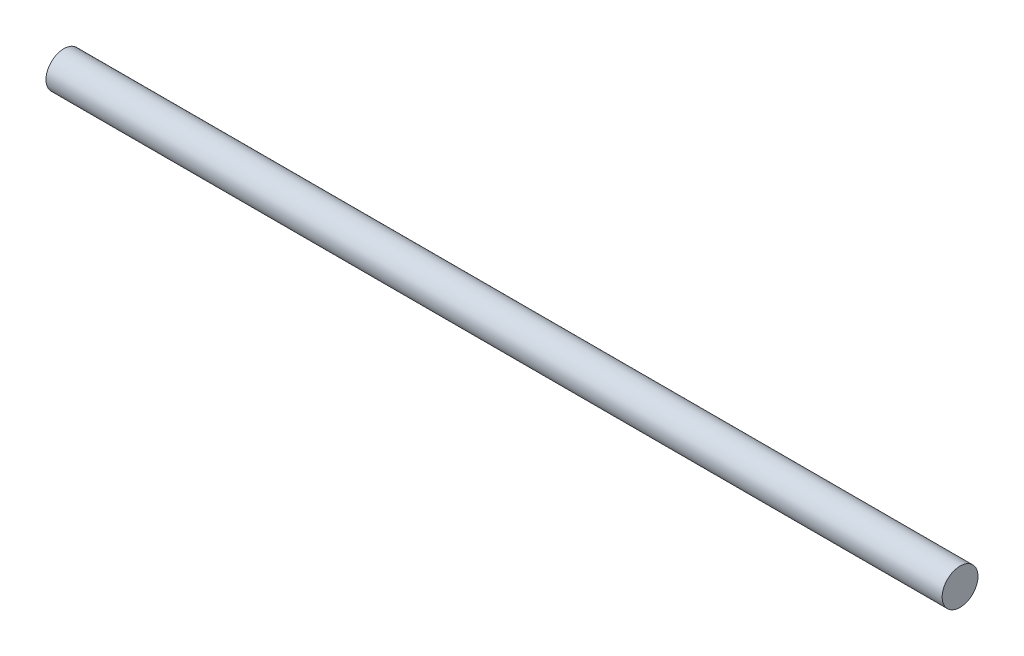
ISO-10303-21;
HEADER;
FILE_DESCRIPTION(('STEP AP214'),'2;1');
FILE_NAME('part.step','',(''),(''),'','','');
FILE_SCHEMA(('AUTOMOTIVE_DESIGN { 1 0 10303 214 1 1 1 1 }'));
ENDSEC;
DATA;
#1=APPLICATION_CONTEXT('core data for automotive mechanical design processes');
#2=APPLICATION_PROTOCOL_DEFINITION('international standard','automotive_design',2000,#1);
#3=PRODUCT_CONTEXT('',#1,'mechanical');
#4=PRODUCT('Part','Part','',(#3));
#5=PRODUCT_RELATED_PRODUCT_CATEGORY('part','',(#4));
#6=PRODUCT_DEFINITION_FORMATION('','',#4);
#7=PRODUCT_DEFINITION_CONTEXT('part definition',#1,'design');
#8=PRODUCT_DEFINITION('design','',#6,#7);
#9=PRODUCT_DEFINITION_SHAPE('','',#8);
#10=(LENGTH_UNIT() NAMED_UNIT(*) SI_UNIT(.MILLI.,.METRE.));
#11=(NAMED_UNIT(*) PLANE_ANGLE_UNIT() SI_UNIT($,.RADIAN.));
#12=(NAMED_UNIT(*) SI_UNIT($,.STERADIAN.) SOLID_ANGLE_UNIT());
#13=UNCERTAINTY_MEASURE_WITH_UNIT(LENGTH_MEASURE(1.E-05),#10,'distance_accuracy_value','');
#14=(GEOMETRIC_REPRESENTATION_CONTEXT(3) GLOBAL_UNCERTAINTY_ASSIGNED_CONTEXT((#13)) GLOBAL_UNIT_ASSIGNED_CONTEXT((#10,
#11,#12)) REPRESENTATION_CONTEXT('',''));
#15=CARTESIAN_POINT('',(0.,0.,0.));
#16=DIRECTION('',(0.,0.,1.));
#17=DIRECTION('',(1.,0.,0.));
#18=AXIS2_PLACEMENT_3D('',#15,#16,#17);
#19=CARTESIAN_POINT('',(39.6875,0.,0.));
#20=DIRECTION('',(-1.,0.,0.));
#21=DIRECTION('',(0.,0.,1.));
#22=AXIS2_PLACEMENT_3D('',#19,#20,#21);
#23=CYLINDRICAL_SURFACE('',#22,1.5875);
#24=CARTESIAN_POINT('',(39.6875,0.,0.));
#25=DIRECTION('',(1.,0.,0.));
#26=DIRECTION('',(0.,0.,-1.));
#27=AXIS2_PLACEMENT_3D('',#24,#25,#26);
#28=CIRCLE('',#27,1.5875);
#29=CARTESIAN_POINT('',(39.6875,0.,-1.5875));
#30=VERTEX_POINT('',#29);
#31=EDGE_CURVE('E12',#30,#30,#28,.T.);
#32=ORIENTED_EDGE('',*,*,#31,.F.);
#33=EDGE_LOOP('',(#32));
#34=FACE_BOUND('',#33,.T.);
#35=CARTESIAN_POINT('',(-39.6875,0.,0.));
#36=DIRECTION('',(1.,0.,0.));
#37=DIRECTION('',(0.,0.,-1.));
#38=AXIS2_PLACEMENT_3D('',#35,#36,#37);
#39=CIRCLE('',#38,1.5875);
#40=CARTESIAN_POINT('',(-39.6875,0.,-1.5875));
#41=VERTEX_POINT('',#40);
#42=EDGE_CURVE('E48',#41,#41,#39,.T.);
#43=ORIENTED_EDGE('',*,*,#42,.T.);
#44=EDGE_LOOP('',(#43));
#45=FACE_BOUND('',#44,.T.);
#46=ADVANCED_FACE('F45',(#34,#45),#23,.T.);
#47=CARTESIAN_POINT('',(39.6875,0.,0.));
#48=DIRECTION('',(1.,0.,0.));
#49=DIRECTION('',(0.,0.,-1.));
#50=AXIS2_PLACEMENT_3D('',#47,#48,#49);
#51=PLANE('',#50);
#52=ORIENTED_EDGE('',*,*,#31,.T.);
#53=EDGE_LOOP('',(#52));
#54=FACE_BOUND('',#53,.T.);
#55=ADVANCED_FACE('F60',(#54),#51,.T.);
#56=CARTESIAN_POINT('',(-39.6875,0.,0.));
#57=DIRECTION('',(1.,0.,0.));
#58=DIRECTION('',(0.,0.,-1.));
#59=AXIS2_PLACEMENT_3D('',#56,#57,#58);
#60=PLANE('',#59);
#61=ORIENTED_EDGE('',*,*,#42,.F.);
#62=EDGE_LOOP('',(#61));
#63=FACE_BOUND('',#62,.T.);
#64=ADVANCED_FACE('F58',(#63),#60,.F.);
#65=CLOSED_SHELL('',(#46,#55,#64));
#66=MANIFOLD_SOLID_BREP('B2',#65);
#67=ADVANCED_BREP_SHAPE_REPRESENTATION('',(#18,#66),#14);
#68=SHAPE_DEFINITION_REPRESENTATION(#9,#67);
ENDSEC;
END-ISO-10303-21;
